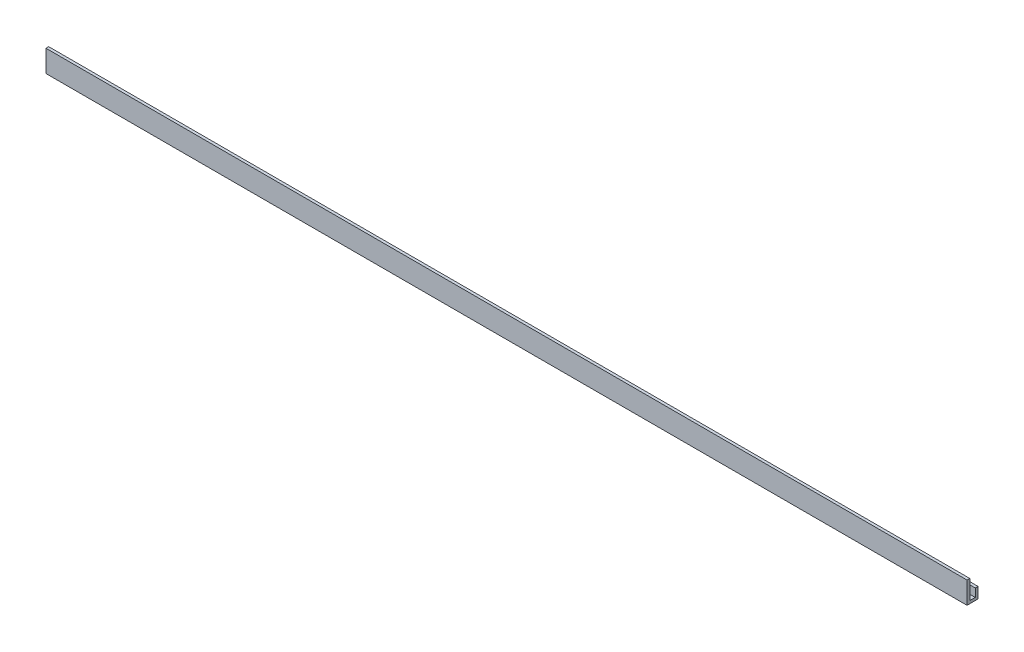
ISO-10303-21;
HEADER;
FILE_DESCRIPTION(('STEP AP214'),'2;1');
FILE_NAME('part.step','',(''),(''),'','','');
FILE_SCHEMA(('AUTOMOTIVE_DESIGN { 1 0 10303 214 1 1 1 1 }'));
ENDSEC;
DATA;
#1=APPLICATION_CONTEXT('core data for automotive mechanical design processes');
#2=APPLICATION_PROTOCOL_DEFINITION('international standard','automotive_design',2000,#1);
#3=PRODUCT_CONTEXT('',#1,'mechanical');
#4=PRODUCT('Part','Part','',(#3));
#5=PRODUCT_RELATED_PRODUCT_CATEGORY('part','',(#4));
#6=PRODUCT_DEFINITION_FORMATION('','',#4);
#7=PRODUCT_DEFINITION_CONTEXT('part definition',#1,'design');
#8=PRODUCT_DEFINITION('design','',#6,#7);
#9=PRODUCT_DEFINITION_SHAPE('','',#8);
#10=(LENGTH_UNIT() NAMED_UNIT(*) SI_UNIT(.MILLI.,.METRE.));
#11=(NAMED_UNIT(*) PLANE_ANGLE_UNIT() SI_UNIT($,.RADIAN.));
#12=(NAMED_UNIT(*) SI_UNIT($,.STERADIAN.) SOLID_ANGLE_UNIT());
#13=UNCERTAINTY_MEASURE_WITH_UNIT(LENGTH_MEASURE(1.E-05),#10,'distance_accuracy_value','');
#14=(GEOMETRIC_REPRESENTATION_CONTEXT(3) GLOBAL_UNCERTAINTY_ASSIGNED_CONTEXT((#13)) GLOBAL_UNIT_ASSIGNED_CONTEXT((#10,
#11,#12)) REPRESENTATION_CONTEXT('',''));
#15=CARTESIAN_POINT('',(0.,0.,0.));
#16=DIRECTION('',(0.,0.,1.));
#17=DIRECTION('',(1.,0.,0.));
#18=AXIS2_PLACEMENT_3D('',#15,#16,#17);
#19=CARTESIAN_POINT('',(-266.7,0.,-3.175));
#20=DIRECTION('',(0.,1.,0.));
#21=DIRECTION('',(0.,0.,1.));
#22=AXIS2_PLACEMENT_3D('',#19,#20,#21);
#23=PLANE('',#22);
#24=DIRECTION('',(1.,0.,0.));
#25=VECTOR('',#24,1.);
#26=CARTESIAN_POINT('',(-266.7,0.,0.));
#27=LINE('',#26,#25);
#28=CARTESIAN_POINT('',(-266.7,0.,0.));
#29=VERTEX_POINT('',#28);
#30=CARTESIAN_POINT('',(266.7,0.,0.));
#31=VERTEX_POINT('',#30);
#32=EDGE_CURVE('E35',#29,#31,#27,.T.);
#33=ORIENTED_EDGE('',*,*,#32,.T.);
#34=DIRECTION('',(0.,0.,1.));
#35=VECTOR('',#34,1.);
#36=CARTESIAN_POINT('',(266.7,0.,-3.175));
#37=LINE('',#36,#35);
#38=CARTESIAN_POINT('',(266.7,0.,-3.175));
#39=VERTEX_POINT('',#38);
#40=EDGE_CURVE('E96',#39,#31,#37,.T.);
#41=ORIENTED_EDGE('',*,*,#40,.F.);
#42=DIRECTION('',(1.,0.,0.));
#43=VECTOR('',#42,1.);
#44=CARTESIAN_POINT('',(-266.7,0.,-3.175));
#45=LINE('',#44,#43);
#46=CARTESIAN_POINT('',(-266.7,0.,-3.175));
#47=VERTEX_POINT('',#46);
#48=EDGE_CURVE('E11',#47,#39,#45,.T.);
#49=ORIENTED_EDGE('',*,*,#48,.F.);
#50=DIRECTION('',(0.,0.,1.));
#51=VECTOR('',#50,1.);
#52=CARTESIAN_POINT('',(-266.7,0.,-3.175));
#53=LINE('',#52,#51);
#54=EDGE_CURVE('E97',#47,#29,#53,.T.);
#55=ORIENTED_EDGE('',*,*,#54,.T.);
#56=EDGE_LOOP('',(#33,#41,#49,#55));
#57=FACE_BOUND('',#56,.T.);
#58=ADVANCED_FACE('F32',(#57),#23,.T.);
#59=CARTESIAN_POINT('',(-266.7,4.7625,-3.175));
#60=DIRECTION('',(0.,0.,1.));
#61=DIRECTION('',(1.,0.,0.));
#62=AXIS2_PLACEMENT_3D('',#59,#60,#61);
#63=PLANE('',#62);
#64=ORIENTED_EDGE('',*,*,#48,.T.);
#65=DIRECTION('',(0.,-1.,0.));
#66=VECTOR('',#65,1.);
#67=CARTESIAN_POINT('',(266.7,4.7625,-3.175));
#68=LINE('',#67,#66);
#69=CARTESIAN_POINT('',(266.7,4.7625,-3.175));
#70=VERTEX_POINT('',#69);
#71=EDGE_CURVE('E114',#70,#39,#68,.T.);
#72=ORIENTED_EDGE('',*,*,#71,.F.);
#73=DIRECTION('',(1.,0.,0.));
#74=VECTOR('',#73,1.);
#75=CARTESIAN_POINT('',(-266.7,4.7625,-3.175));
#76=LINE('',#75,#74);
#77=CARTESIAN_POINT('',(-266.7,4.7625,-3.175));
#78=VERTEX_POINT('',#77);
#79=EDGE_CURVE('E40',#78,#70,#76,.T.);
#80=ORIENTED_EDGE('',*,*,#79,.F.);
#81=DIRECTION('',(0.,-1.,0.));
#82=VECTOR('',#81,1.);
#83=CARTESIAN_POINT('',(-266.7,4.7625,-3.175));
#84=LINE('',#83,#82);
#85=EDGE_CURVE('E102',#78,#47,#84,.T.);
#86=ORIENTED_EDGE('',*,*,#85,.T.);
#87=EDGE_LOOP('',(#64,#72,#80,#86));
#88=FACE_BOUND('',#87,.T.);
#89=ADVANCED_FACE('F178',(#88),#63,.T.);
#90=CARTESIAN_POINT('',(-266.7,4.7625,-4.7625));
#91=DIRECTION('',(0.,1.,0.));
#92=DIRECTION('',(0.,0.,1.));
#93=AXIS2_PLACEMENT_3D('',#90,#91,#92);
#94=PLANE('',#93);
#95=ORIENTED_EDGE('',*,*,#79,.T.);
#96=DIRECTION('',(0.,0.,1.));
#97=VECTOR('',#96,1.);
#98=CARTESIAN_POINT('',(266.7,4.7625,-4.7625));
#99=LINE('',#98,#97);
#100=CARTESIAN_POINT('',(266.7,4.7625,-4.7625));
#101=VERTEX_POINT('',#100);
#102=EDGE_CURVE('E127',#101,#70,#99,.T.);
#103=ORIENTED_EDGE('',*,*,#102,.F.);
#104=DIRECTION('',(1.,0.,0.));
#105=VECTOR('',#104,1.);
#106=CARTESIAN_POINT('',(-266.7,4.7625,-4.7625));
#107=LINE('',#106,#105);
#108=CARTESIAN_POINT('',(-266.7,4.7625,-4.7625));
#109=VERTEX_POINT('',#108);
#110=EDGE_CURVE('E149',#109,#101,#107,.T.);
#111=ORIENTED_EDGE('',*,*,#110,.F.);
#112=DIRECTION('',(0.,0.,1.));
#113=VECTOR('',#112,1.);
#114=CARTESIAN_POINT('',(-266.7,4.7625,-4.7625));
#115=LINE('',#114,#113);
#116=EDGE_CURVE('E145',#109,#78,#115,.T.);
#117=ORIENTED_EDGE('',*,*,#116,.T.);
#118=EDGE_LOOP('',(#95,#103,#111,#117));
#119=FACE_BOUND('',#118,.T.);
#120=ADVANCED_FACE('F177',(#119),#94,.T.);
#121=CARTESIAN_POINT('',(-266.7,-1.5875,-4.7625));
#122=DIRECTION('',(0.,0.,-1.));
#123=DIRECTION('',(-1.,0.,0.));
#124=AXIS2_PLACEMENT_3D('',#121,#122,#123);
#125=PLANE('',#124);
#126=ORIENTED_EDGE('',*,*,#110,.T.);
#127=DIRECTION('',(0.,1.,0.));
#128=VECTOR('',#127,1.);
#129=CARTESIAN_POINT('',(266.7,-1.5875,-4.7625));
#130=LINE('',#129,#128);
#131=CARTESIAN_POINT('',(266.7,-1.5875,-4.7625));
#132=VERTEX_POINT('',#131);
#133=EDGE_CURVE('E124',#132,#101,#130,.T.);
#134=ORIENTED_EDGE('',*,*,#133,.F.);
#135=DIRECTION('',(1.,0.,0.));
#136=VECTOR('',#135,1.);
#137=CARTESIAN_POINT('',(-266.7,-1.5875,-4.7625));
#138=LINE('',#137,#136);
#139=CARTESIAN_POINT('',(-266.7,-1.5875,-4.7625));
#140=VERTEX_POINT('',#139);
#141=EDGE_CURVE('E151',#140,#132,#138,.T.);
#142=ORIENTED_EDGE('',*,*,#141,.F.);
#143=DIRECTION('',(0.,1.,0.));
#144=VECTOR('',#143,1.);
#145=CARTESIAN_POINT('',(-266.7,-1.5875,-4.7625));
#146=LINE('',#145,#144);
#147=EDGE_CURVE('E142',#140,#109,#146,.T.);
#148=ORIENTED_EDGE('',*,*,#147,.T.);
#149=EDGE_LOOP('',(#126,#134,#142,#148));
#150=FACE_BOUND('',#149,.T.);
#151=ADVANCED_FACE('F173',(#150),#125,.T.);
#152=CARTESIAN_POINT('',(-266.7,-1.5875,1.5875));
#153=DIRECTION('',(0.,-1.,0.));
#154=DIRECTION('',(0.,0.,-1.));
#155=AXIS2_PLACEMENT_3D('',#152,#153,#154);
#156=PLANE('',#155);
#157=ORIENTED_EDGE('',*,*,#141,.T.);
#158=DIRECTION('',(0.,0.,-1.));
#159=VECTOR('',#158,1.);
#160=CARTESIAN_POINT('',(266.7,-1.5875,1.5875));
#161=LINE('',#160,#159);
#162=CARTESIAN_POINT('',(266.7,-1.5875,1.5875));
#163=VERTEX_POINT('',#162);
#164=EDGE_CURVE('E121',#163,#132,#161,.T.);
#165=ORIENTED_EDGE('',*,*,#164,.F.);
#166=DIRECTION('',(1.,0.,0.));
#167=VECTOR('',#166,1.);
#168=CARTESIAN_POINT('',(-266.7,-1.5875,1.5875));
#169=LINE('',#168,#167);
#170=CARTESIAN_POINT('',(-266.7,-1.5875,1.5875));
#171=VERTEX_POINT('',#170);
#172=EDGE_CURVE('E153',#171,#163,#169,.T.);
#173=ORIENTED_EDGE('',*,*,#172,.F.);
#174=DIRECTION('',(0.,0.,-1.));
#175=VECTOR('',#174,1.);
#176=CARTESIAN_POINT('',(-266.7,-1.5875,1.5875));
#177=LINE('',#176,#175);
#178=EDGE_CURVE('E139',#171,#140,#177,.T.);
#179=ORIENTED_EDGE('',*,*,#178,.T.);
#180=EDGE_LOOP('',(#157,#165,#173,#179));
#181=FACE_BOUND('',#180,.T.);
#182=ADVANCED_FACE('F166',(#181),#156,.T.);
#183=CARTESIAN_POINT('',(-266.7,11.1125,1.5875));
#184=DIRECTION('',(0.,0.,1.));
#185=DIRECTION('',(0.,-1.,0.));
#186=AXIS2_PLACEMENT_3D('',#183,#184,#185);
#187=PLANE('',#186);
#188=ORIENTED_EDGE('',*,*,#172,.T.);
#189=DIRECTION('',(0.,-1.,0.));
#190=VECTOR('',#189,1.);
#191=CARTESIAN_POINT('',(266.7,11.1125,1.5875));
#192=LINE('',#191,#190);
#193=CARTESIAN_POINT('',(266.7,11.1125,1.5875));
#194=VERTEX_POINT('',#193);
#195=EDGE_CURVE('E118',#194,#163,#192,.T.);
#196=ORIENTED_EDGE('',*,*,#195,.F.);
#197=DIRECTION('',(1.,0.,0.));
#198=VECTOR('',#197,1.);
#199=CARTESIAN_POINT('',(-266.7,11.1125,1.5875));
#200=LINE('',#199,#198);
#201=CARTESIAN_POINT('',(-266.7,11.1125,1.5875));
#202=VERTEX_POINT('',#201);
#203=EDGE_CURVE('E155',#202,#194,#200,.T.);
#204=ORIENTED_EDGE('',*,*,#203,.F.);
#205=DIRECTION('',(0.,-1.,0.));
#206=VECTOR('',#205,1.);
#207=CARTESIAN_POINT('',(-266.7,11.1125,1.5875));
#208=LINE('',#207,#206);
#209=EDGE_CURVE('E136',#202,#171,#208,.T.);
#210=ORIENTED_EDGE('',*,*,#209,.T.);
#211=EDGE_LOOP('',(#188,#196,#204,#210));
#212=FACE_BOUND('',#211,.T.);
#213=ADVANCED_FACE('F163',(#212),#187,.T.);
#214=CARTESIAN_POINT('',(-266.7,11.1125,0.));
#215=DIRECTION('',(0.,1.,0.));
#216=DIRECTION('',(0.,0.,1.));
#217=AXIS2_PLACEMENT_3D('',#214,#215,#216);
#218=PLANE('',#217);
#219=ORIENTED_EDGE('',*,*,#203,.T.);
#220=DIRECTION('',(0.,0.,1.));
#221=VECTOR('',#220,1.);
#222=CARTESIAN_POINT('',(266.7,11.1125,0.));
#223=LINE('',#222,#221);
#224=CARTESIAN_POINT('',(266.7,11.1125,0.));
#225=VERTEX_POINT('',#224);
#226=EDGE_CURVE('E109',#225,#194,#223,.T.);
#227=ORIENTED_EDGE('',*,*,#226,.F.);
#228=DIRECTION('',(1.,0.,0.));
#229=VECTOR('',#228,1.);
#230=CARTESIAN_POINT('',(-266.7,11.1125,0.));
#231=LINE('',#230,#229);
#232=CARTESIAN_POINT('',(-266.7,11.1125,0.));
#233=VERTEX_POINT('',#232);
#234=EDGE_CURVE('E101',#233,#225,#231,.T.);
#235=ORIENTED_EDGE('',*,*,#234,.F.);
#236=DIRECTION('',(0.,0.,1.));
#237=VECTOR('',#236,1.);
#238=CARTESIAN_POINT('',(-266.7,11.1125,0.));
#239=LINE('',#238,#237);
#240=EDGE_CURVE('E133',#233,#202,#239,.T.);
#241=ORIENTED_EDGE('',*,*,#240,.T.);
#242=EDGE_LOOP('',(#219,#227,#235,#241));
#243=FACE_BOUND('',#242,.T.);
#244=ADVANCED_FACE('F157',(#243),#218,.T.);
#245=CARTESIAN_POINT('',(-266.7,0.,0.));
#246=DIRECTION('',(0.,0.,-1.));
#247=DIRECTION('',(0.,1.,0.));
#248=AXIS2_PLACEMENT_3D('',#245,#246,#247);
#249=PLANE('',#248);
#250=ORIENTED_EDGE('',*,*,#234,.T.);
#251=DIRECTION('',(0.,1.,0.));
#252=VECTOR('',#251,1.);
#253=CARTESIAN_POINT('',(266.7,0.,0.));
#254=LINE('',#253,#252);
#255=EDGE_CURVE('E104',#31,#225,#254,.T.);
#256=ORIENTED_EDGE('',*,*,#255,.F.);
#257=ORIENTED_EDGE('',*,*,#32,.F.);
#258=DIRECTION('',(0.,1.,0.));
#259=VECTOR('',#258,1.);
#260=CARTESIAN_POINT('',(-266.7,0.,0.));
#261=LINE('',#260,#259);
#262=EDGE_CURVE('E131',#29,#233,#261,.T.);
#263=ORIENTED_EDGE('',*,*,#262,.T.);
#264=EDGE_LOOP('',(#250,#256,#257,#263));
#265=FACE_BOUND('',#264,.T.);
#266=ADVANCED_FACE('F105',(#265),#249,.T.);
#267=CARTESIAN_POINT('',(-266.7,0.,0.));
#268=DIRECTION('',(-1.,0.,0.));
#269=DIRECTION('',(0.,0.,1.));
#270=AXIS2_PLACEMENT_3D('',#267,#268,#269);
#271=PLANE('',#270);
#272=ORIENTED_EDGE('',*,*,#54,.F.);
#273=ORIENTED_EDGE('',*,*,#85,.F.);
#274=ORIENTED_EDGE('',*,*,#116,.F.);
#275=ORIENTED_EDGE('',*,*,#147,.F.);
#276=ORIENTED_EDGE('',*,*,#178,.F.);
#277=ORIENTED_EDGE('',*,*,#209,.F.);
#278=ORIENTED_EDGE('',*,*,#240,.F.);
#279=ORIENTED_EDGE('',*,*,#262,.F.);
#280=EDGE_LOOP('',(#272,#273,#274,#275,#276,#277,#278,#279));
#281=FACE_BOUND('',#280,.T.);
#282=ADVANCED_FACE('F169',(#281),#271,.T.);
#283=CARTESIAN_POINT('',(266.7,0.,0.));
#284=DIRECTION('',(-1.,0.,0.));
#285=DIRECTION('',(0.,0.,1.));
#286=AXIS2_PLACEMENT_3D('',#283,#284,#285);
#287=PLANE('',#286);
#288=ORIENTED_EDGE('',*,*,#40,.T.);
#289=ORIENTED_EDGE('',*,*,#255,.T.);
#290=ORIENTED_EDGE('',*,*,#226,.T.);
#291=ORIENTED_EDGE('',*,*,#195,.T.);
#292=ORIENTED_EDGE('',*,*,#164,.T.);
#293=ORIENTED_EDGE('',*,*,#133,.T.);
#294=ORIENTED_EDGE('',*,*,#102,.T.);
#295=ORIENTED_EDGE('',*,*,#71,.T.);
#296=EDGE_LOOP('',(#288,#289,#290,#291,#292,#293,#294,#295));
#297=FACE_BOUND('',#296,.T.);
#298=ADVANCED_FACE('F112',(#297),#287,.F.);
#299=CLOSED_SHELL('',(#58,#89,#120,#151,#182,#213,#244,#266,#282,#298));
#300=MANIFOLD_SOLID_BREP('B2',#299);
#301=ADVANCED_BREP_SHAPE_REPRESENTATION('',(#18,#300),#14);
#302=SHAPE_DEFINITION_REPRESENTATION(#9,#301);
ENDSEC;
END-ISO-10303-21;
